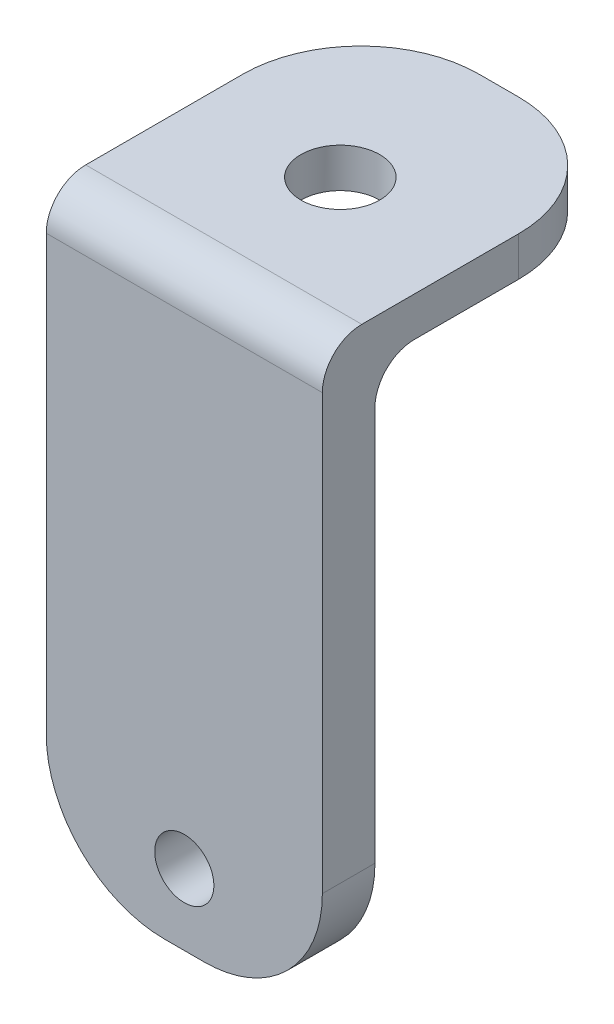
ISO-10303-21;
HEADER;
FILE_DESCRIPTION(('STEP AP214'),'2;1');
FILE_NAME('part.step','',(''),(''),'','','');
FILE_SCHEMA(('AUTOMOTIVE_DESIGN { 1 0 10303 214 1 1 1 1 }'));
ENDSEC;
DATA;
#1=APPLICATION_CONTEXT('core data for automotive mechanical design processes');
#2=APPLICATION_PROTOCOL_DEFINITION('international standard','automotive_design',2000,#1);
#3=PRODUCT_CONTEXT('',#1,'mechanical');
#4=PRODUCT('Part','Part','',(#3));
#5=PRODUCT_RELATED_PRODUCT_CATEGORY('part','',(#4));
#6=PRODUCT_DEFINITION_FORMATION('','',#4);
#7=PRODUCT_DEFINITION_CONTEXT('part definition',#1,'design');
#8=PRODUCT_DEFINITION('design','',#6,#7);
#9=PRODUCT_DEFINITION_SHAPE('','',#8);
#10=(LENGTH_UNIT() NAMED_UNIT(*) SI_UNIT(.MILLI.,.METRE.));
#11=(NAMED_UNIT(*) PLANE_ANGLE_UNIT() SI_UNIT($,.RADIAN.));
#12=(NAMED_UNIT(*) SI_UNIT($,.STERADIAN.) SOLID_ANGLE_UNIT());
#13=UNCERTAINTY_MEASURE_WITH_UNIT(LENGTH_MEASURE(1.E-05),#10,'distance_accuracy_value','');
#14=(GEOMETRIC_REPRESENTATION_CONTEXT(3) GLOBAL_UNCERTAINTY_ASSIGNED_CONTEXT((#13)) GLOBAL_UNIT_ASSIGNED_CONTEXT((#10,
#11,#12)) REPRESENTATION_CONTEXT('',''));
#15=CARTESIAN_POINT('',(0.,0.,0.));
#16=DIRECTION('',(0.,0.,1.));
#17=DIRECTION('',(1.,0.,0.));
#18=AXIS2_PLACEMENT_3D('',#15,#16,#17);
#19=CARTESIAN_POINT('',(-35.,210.217693310135,42.0569210181725));
#20=DIRECTION('',(0.,1.,0.));
#21=DIRECTION('',(0.,0.,1.));
#22=AXIS2_PLACEMENT_3D('',#19,#20,#21);
#23=PLANE('',#22);
#24=CARTESIAN_POINT('',(0.,210.217693310135,2.5));
#25=DIRECTION('',(0.,1.,0.));
#26=DIRECTION('',(0.,0.,1.));
#27=AXIS2_PLACEMENT_3D('',#24,#25,#26);
#28=CIRCLE('',#27,10.);
#29=CARTESIAN_POINT('',(0.,210.217693310135,12.5));
#30=VERTEX_POINT('',#29);
#31=EDGE_CURVE('E169',#30,#30,#28,.T.);
#32=ORIENTED_EDGE('',*,*,#31,.F.);
#33=EDGE_LOOP('',(#32));
#34=FACE_BOUND('',#33,.T.);
#35=DIRECTION('',(0.,0.,1.));
#36=VECTOR('',#35,1.);
#37=CARTESIAN_POINT('',(-35.,210.217693310135,42.0569210181725));
#38=LINE('',#37,#36);
#39=CARTESIAN_POINT('',(-35.,210.217693310135,-7.73203002231183));
#40=VERTEX_POINT('',#39);
#41=CARTESIAN_POINT('',(-35.,210.217693310135,32.0569210181725));
#42=VERTEX_POINT('',#41);
#43=EDGE_CURVE('E158',#40,#42,#38,.T.);
#44=ORIENTED_EDGE('',*,*,#43,.T.);
#45=DIRECTION('',(1.,0.,0.));
#46=VECTOR('',#45,1.);
#47=CARTESIAN_POINT('',(-35.,210.217693310135,32.0569210181725));
#48=LINE('',#47,#46);
#49=CARTESIAN_POINT('',(35.,210.217693310135,32.0569210181725));
#50=VERTEX_POINT('',#49);
#51=EDGE_CURVE('E200',#42,#50,#48,.T.);
#52=ORIENTED_EDGE('',*,*,#51,.T.);
#53=DIRECTION('',(0.,0.,1.));
#54=VECTOR('',#53,1.);
#55=CARTESIAN_POINT('',(35.,210.217693310135,42.0569210181725));
#56=LINE('',#55,#54);
#57=CARTESIAN_POINT('',(35.,210.217693310135,-7.73203002231183));
#58=VERTEX_POINT('',#57);
#59=EDGE_CURVE('E224',#58,#50,#56,.T.);
#60=ORIENTED_EDGE('',*,*,#59,.F.);
#61=CARTESIAN_POINT('',(4.99999999999998,210.217693310135,-7.73203002231183));
#62=DIRECTION('',(0.,1.,0.));
#63=DIRECTION('',(0.,0.,1.));
#64=AXIS2_PLACEMENT_3D('',#61,#62,#63);
#65=CIRCLE('',#64,30.);
#66=CARTESIAN_POINT('',(4.99999999999998,210.217693310135,-37.7320300223118));
#67=VERTEX_POINT('',#66);
#68=EDGE_CURVE('E140',#58,#67,#65,.T.);
#69=ORIENTED_EDGE('',*,*,#68,.T.);
#70=DIRECTION('',(1.,0.,0.));
#71=VECTOR('',#70,1.);
#72=CARTESIAN_POINT('',(-35.,210.217693310135,-37.7320300223118));
#73=LINE('',#72,#71);
#74=CARTESIAN_POINT('',(-5.,210.217693310135,-37.7320300223118));
#75=VERTEX_POINT('',#74);
#76=EDGE_CURVE('E146',#75,#67,#73,.T.);
#77=ORIENTED_EDGE('',*,*,#76,.F.);
#78=CARTESIAN_POINT('',(-5.,210.217693310135,-7.73203002231183));
#79=DIRECTION('',(0.,1.,0.));
#80=DIRECTION('',(0.,0.,1.));
#81=AXIS2_PLACEMENT_3D('',#78,#79,#80);
#82=CIRCLE('',#81,30.);
#83=EDGE_CURVE('E128',#75,#40,#82,.T.);
#84=ORIENTED_EDGE('',*,*,#83,.T.);
#85=EDGE_LOOP('',(#44,#52,#60,#69,#77,#84));
#86=FACE_BOUND('',#85,.T.);
#87=ADVANCED_FACE('F39',(#34,#86),#23,.T.);
#88=CARTESIAN_POINT('',(-35.,210.217693310135,-37.7320300223118));
#89=DIRECTION('',(0.,0.,-1.));
#90=DIRECTION('',(0.,1.,0.));
#91=AXIS2_PLACEMENT_3D('',#88,#89,#90);
#92=PLANE('',#91);
#93=DIRECTION('',(1.,0.,0.));
#94=VECTOR('',#93,1.);
#95=CARTESIAN_POINT('',(-35.,200.217693310135,-37.7320300223118));
#96=LINE('',#95,#94);
#97=CARTESIAN_POINT('',(-5.,200.217693310135,-37.7320300223118));
#98=VERTEX_POINT('',#97);
#99=CARTESIAN_POINT('',(4.99999999999998,200.217693310135,-37.7320300223118));
#100=VERTEX_POINT('',#99);
#101=EDGE_CURVE('E149',#98,#100,#96,.T.);
#102=ORIENTED_EDGE('',*,*,#101,.F.);
#103=DIRECTION('',(0.,1.,0.));
#104=VECTOR('',#103,1.);
#105=CARTESIAN_POINT('',(-5.,210.217693310135,-37.7320300223118));
#106=LINE('',#105,#104);
#107=EDGE_CURVE('E132',#98,#75,#106,.T.);
#108=ORIENTED_EDGE('',*,*,#107,.T.);
#109=ORIENTED_EDGE('',*,*,#76,.T.);
#110=DIRECTION('',(0.,1.,0.));
#111=VECTOR('',#110,1.);
#112=CARTESIAN_POINT('',(4.99999999999998,210.217693310135,-37.7320300223118));
#113=LINE('',#112,#111);
#114=EDGE_CURVE('E150',#67,#100,#113,.F.);
#115=ORIENTED_EDGE('',*,*,#114,.T.);
#116=EDGE_LOOP('',(#102,#108,#109,#115));
#117=FACE_BOUND('',#116,.T.);
#118=ADVANCED_FACE('F145',(#117),#92,.T.);
#119=CARTESIAN_POINT('',(-35.,200.217693310135,28.7170376465665));
#120=DIRECTION('',(0.,-1.,0.));
#121=DIRECTION('',(0.,0.,-1.));
#122=AXIS2_PLACEMENT_3D('',#119,#120,#121);
#123=PLANE('',#122);
#124=CARTESIAN_POINT('',(0.,200.217693310135,2.5));
#125=DIRECTION('',(0.,-1.,0.));
#126=DIRECTION('',(0.,0.,-1.));
#127=AXIS2_PLACEMENT_3D('',#124,#125,#126);
#128=CIRCLE('',#127,10.);
#129=CARTESIAN_POINT('',(0.,200.217693310135,-7.5));
#130=VERTEX_POINT('',#129);
#131=EDGE_CURVE('E166',#130,#130,#128,.T.);
#132=ORIENTED_EDGE('',*,*,#131,.F.);
#133=EDGE_LOOP('',(#132));
#134=FACE_BOUND('',#133,.T.);
#135=DIRECTION('',(0.,0.,-1.));
#136=VECTOR('',#135,1.);
#137=CARTESIAN_POINT('',(35.,200.217693310135,28.7170376465665));
#138=LINE('',#137,#136);
#139=CARTESIAN_POINT('',(35.,200.217693310135,18.7170376465665));
#140=VERTEX_POINT('',#139);
#141=CARTESIAN_POINT('',(35.,200.217693310135,-7.73203002231183));
#142=VERTEX_POINT('',#141);
#143=EDGE_CURVE('E216',#140,#142,#138,.T.);
#144=ORIENTED_EDGE('',*,*,#143,.F.);
#145=DIRECTION('',(1.,0.,0.));
#146=VECTOR('',#145,1.);
#147=CARTESIAN_POINT('',(-35.,200.217693310135,18.7170376465665));
#148=LINE('',#147,#146);
#149=CARTESIAN_POINT('',(-35.,200.217693310135,18.7170376465665));
#150=VERTEX_POINT('',#149);
#151=EDGE_CURVE('E60',#140,#150,#148,.F.);
#152=ORIENTED_EDGE('',*,*,#151,.T.);
#153=DIRECTION('',(0.,0.,-1.));
#154=VECTOR('',#153,1.);
#155=CARTESIAN_POINT('',(-35.,200.217693310135,28.7170376465665));
#156=LINE('',#155,#154);
#157=CARTESIAN_POINT('',(-35.,200.217693310135,-7.73203002231183));
#158=VERTEX_POINT('',#157);
#159=EDGE_CURVE('E231',#150,#158,#156,.T.);
#160=ORIENTED_EDGE('',*,*,#159,.T.);
#161=CARTESIAN_POINT('',(-5.,200.217693310135,-7.73203002231183));
#162=DIRECTION('',(0.,-1.,0.));
#163=DIRECTION('',(0.,0.,-1.));
#164=AXIS2_PLACEMENT_3D('',#161,#162,#163);
#165=CIRCLE('',#164,30.);
#166=EDGE_CURVE('E178',#158,#98,#165,.T.);
#167=ORIENTED_EDGE('',*,*,#166,.T.);
#168=ORIENTED_EDGE('',*,*,#101,.T.);
#169=CARTESIAN_POINT('',(4.99999999999998,200.217693310135,-7.73203002231183));
#170=DIRECTION('',(0.,-1.,0.));
#171=DIRECTION('',(0.,0.,-1.));
#172=AXIS2_PLACEMENT_3D('',#169,#170,#171);
#173=CIRCLE('',#172,30.);
#174=EDGE_CURVE('E175',#100,#142,#173,.T.);
#175=ORIENTED_EDGE('',*,*,#174,.T.);
#176=EDGE_LOOP('',(#144,#152,#160,#167,#168,#175));
#177=FACE_BOUND('',#176,.T.);
#178=ADVANCED_FACE('F221',(#134,#177),#123,.T.);
#179=CARTESIAN_POINT('',(-35.,60.2176933101346,28.7170376465665));
#180=DIRECTION('',(0.,0.,-1.));
#181=DIRECTION('',(-1.,0.,0.));
#182=AXIS2_PLACEMENT_3D('',#179,#180,#181);
#183=PLANE('',#182);
#184=CARTESIAN_POINT('',(0.,78.2176933101346,28.7170376465665));
#185=DIRECTION('',(0.,0.,-1.));
#186=DIRECTION('',(-1.,0.,0.));
#187=AXIS2_PLACEMENT_3D('',#184,#185,#186);
#188=CIRCLE('',#187,7.50000000000001);
#189=CARTESIAN_POINT('',(-7.5,78.2176933101346,28.7170376465665));
#190=VERTEX_POINT('',#189);
#191=EDGE_CURVE('E241',#190,#190,#188,.T.);
#192=ORIENTED_EDGE('',*,*,#191,.F.);
#193=EDGE_LOOP('',(#192));
#194=FACE_BOUND('',#193,.T.);
#195=DIRECTION('',(0.,1.,0.));
#196=VECTOR('',#195,1.);
#197=CARTESIAN_POINT('',(-35.,60.2176933101346,28.7170376465665));
#198=LINE('',#197,#196);
#199=CARTESIAN_POINT('',(-35.,90.2176933101346,28.7170376465665));
#200=VERTEX_POINT('',#199);
#201=CARTESIAN_POINT('',(-35.,190.217693310135,28.7170376465665));
#202=VERTEX_POINT('',#201);
#203=EDGE_CURVE('E228',#200,#202,#198,.T.);
#204=ORIENTED_EDGE('',*,*,#203,.T.);
#205=DIRECTION('',(1.,0.,0.));
#206=VECTOR('',#205,1.);
#207=CARTESIAN_POINT('',(35.,190.217693310135,28.7170376465665));
#208=LINE('',#207,#206);
#209=CARTESIAN_POINT('',(35.,190.217693310135,28.7170376465665));
#210=VERTEX_POINT('',#209);
#211=EDGE_CURVE('E209',#202,#210,#208,.T.);
#212=ORIENTED_EDGE('',*,*,#211,.T.);
#213=DIRECTION('',(0.,1.,0.));
#214=VECTOR('',#213,1.);
#215=CARTESIAN_POINT('',(35.,60.2176933101346,28.7170376465665));
#216=LINE('',#215,#214);
#217=CARTESIAN_POINT('',(35.,90.2176933101346,28.7170376465665));
#218=VERTEX_POINT('',#217);
#219=EDGE_CURVE('E218',#218,#210,#216,.T.);
#220=ORIENTED_EDGE('',*,*,#219,.F.);
#221=CARTESIAN_POINT('',(4.99999999999998,90.2176933101346,28.7170376465665));
#222=DIRECTION('',(0.,0.,-1.));
#223=DIRECTION('',(-1.,0.,0.));
#224=AXIS2_PLACEMENT_3D('',#221,#222,#223);
#225=CIRCLE('',#224,30.);
#226=CARTESIAN_POINT('',(4.99999999999998,60.2176933101346,28.7170376465665));
#227=VERTEX_POINT('',#226);
#228=EDGE_CURVE('E191',#218,#227,#225,.T.);
#229=ORIENTED_EDGE('',*,*,#228,.T.);
#230=DIRECTION('',(1.,0.,0.));
#231=VECTOR('',#230,1.);
#232=CARTESIAN_POINT('',(-35.,60.2176933101346,28.7170376465665));
#233=LINE('',#232,#231);
#234=CARTESIAN_POINT('',(-5.,60.2176933101346,28.7170376465665));
#235=VERTEX_POINT('',#234);
#236=EDGE_CURVE('E155',#235,#227,#233,.T.);
#237=ORIENTED_EDGE('',*,*,#236,.F.);
#238=CARTESIAN_POINT('',(-5.,90.2176933101346,28.7170376465665));
#239=DIRECTION('',(0.,0.,-1.));
#240=DIRECTION('',(-1.,0.,0.));
#241=AXIS2_PLACEMENT_3D('',#238,#239,#240);
#242=CIRCLE('',#241,30.);
#243=EDGE_CURVE('E193',#235,#200,#242,.T.);
#244=ORIENTED_EDGE('',*,*,#243,.T.);
#245=EDGE_LOOP('',(#204,#212,#220,#229,#237,#244));
#246=FACE_BOUND('',#245,.T.);
#247=ADVANCED_FACE('F227',(#194,#246),#183,.T.);
#248=CARTESIAN_POINT('',(-35.,60.2176933101346,42.0569210181725));
#249=DIRECTION('',(0.,-1.,0.));
#250=DIRECTION('',(0.,0.,-1.));
#251=AXIS2_PLACEMENT_3D('',#248,#249,#250);
#252=PLANE('',#251);
#253=DIRECTION('',(1.,0.,0.));
#254=VECTOR('',#253,1.);
#255=CARTESIAN_POINT('',(-35.,60.2176933101346,42.0569210181725));
#256=LINE('',#255,#254);
#257=CARTESIAN_POINT('',(-5.,60.2176933101346,42.0569210181725));
#258=VERTEX_POINT('',#257);
#259=CARTESIAN_POINT('',(4.99999999999998,60.2176933101346,42.0569210181725));
#260=VERTEX_POINT('',#259);
#261=EDGE_CURVE('E163',#258,#260,#256,.T.);
#262=ORIENTED_EDGE('',*,*,#261,.F.);
#263=DIRECTION('',(0.,0.,-1.));
#264=VECTOR('',#263,1.);
#265=CARTESIAN_POINT('',(-5.,60.2176933101346,28.7170376465665));
#266=LINE('',#265,#264);
#267=EDGE_CURVE('E188',#258,#235,#266,.T.);
#268=ORIENTED_EDGE('',*,*,#267,.T.);
#269=ORIENTED_EDGE('',*,*,#236,.T.);
#270=DIRECTION('',(0.,0.,-1.));
#271=VECTOR('',#270,1.);
#272=CARTESIAN_POINT('',(4.99999999999998,60.2176933101346,42.0569210181725));
#273=LINE('',#272,#271);
#274=EDGE_CURVE('E186',#227,#260,#273,.F.);
#275=ORIENTED_EDGE('',*,*,#274,.T.);
#276=EDGE_LOOP('',(#262,#268,#269,#275));
#277=FACE_BOUND('',#276,.T.);
#278=ADVANCED_FACE('F254',(#277),#252,.T.);
#279=CARTESIAN_POINT('',(-35.,166.399972685061,42.0569210181725));
#280=DIRECTION('',(0.,0.,1.));
#281=DIRECTION('',(1.,0.,0.));
#282=AXIS2_PLACEMENT_3D('',#279,#280,#281);
#283=PLANE('',#282);
#284=CARTESIAN_POINT('',(0.,78.2176933101346,42.0569210181725));
#285=DIRECTION('',(0.,0.,1.));
#286=DIRECTION('',(1.,0.,0.));
#287=AXIS2_PLACEMENT_3D('',#284,#285,#286);
#288=CIRCLE('',#287,7.50000000000001);
#289=CARTESIAN_POINT('',(7.50000000000001,78.2176933101346,42.0569210181725));
#290=VERTEX_POINT('',#289);
#291=EDGE_CURVE('E244',#290,#290,#288,.T.);
#292=ORIENTED_EDGE('',*,*,#291,.F.);
#293=EDGE_LOOP('',(#292));
#294=FACE_BOUND('',#293,.T.);
#295=DIRECTION('',(0.,-1.,0.));
#296=VECTOR('',#295,1.);
#297=CARTESIAN_POINT('',(35.,210.217693310135,42.0569210181725));
#298=LINE('',#297,#296);
#299=CARTESIAN_POINT('',(35.,200.217693310135,42.0569210181725));
#300=VERTEX_POINT('',#299);
#301=CARTESIAN_POINT('',(35.,90.2176933101346,42.0569210181725));
#302=VERTEX_POINT('',#301);
#303=EDGE_CURVE('E168',#300,#302,#298,.T.);
#304=ORIENTED_EDGE('',*,*,#303,.F.);
#305=DIRECTION('',(1.,0.,0.));
#306=VECTOR('',#305,1.);
#307=CARTESIAN_POINT('',(-35.,200.217693310135,42.0569210181725));
#308=LINE('',#307,#306);
#309=CARTESIAN_POINT('',(-35.,200.217693310135,42.0569210181725));
#310=VERTEX_POINT('',#309);
#311=EDGE_CURVE('E205',#300,#310,#308,.F.);
#312=ORIENTED_EDGE('',*,*,#311,.T.);
#313=DIRECTION('',(0.,-1.,0.));
#314=VECTOR('',#313,1.);
#315=CARTESIAN_POINT('',(-35.,210.217693310135,42.0569210181725));
#316=LINE('',#315,#314);
#317=CARTESIAN_POINT('',(-35.,90.2176933101346,42.0569210181725));
#318=VERTEX_POINT('',#317);
#319=EDGE_CURVE('E232',#310,#318,#316,.T.);
#320=ORIENTED_EDGE('',*,*,#319,.T.);
#321=CARTESIAN_POINT('',(-5.,90.2176933101346,42.0569210181725));
#322=DIRECTION('',(0.,0.,1.));
#323=DIRECTION('',(1.,0.,0.));
#324=AXIS2_PLACEMENT_3D('',#321,#322,#323);
#325=CIRCLE('',#324,30.);
#326=EDGE_CURVE('E198',#318,#258,#325,.T.);
#327=ORIENTED_EDGE('',*,*,#326,.T.);
#328=ORIENTED_EDGE('',*,*,#261,.T.);
#329=CARTESIAN_POINT('',(4.99999999999998,90.2176933101346,42.0569210181725));
#330=DIRECTION('',(0.,0.,1.));
#331=DIRECTION('',(1.,0.,0.));
#332=AXIS2_PLACEMENT_3D('',#329,#330,#331);
#333=CIRCLE('',#332,30.);
#334=EDGE_CURVE('E195',#260,#302,#333,.T.);
#335=ORIENTED_EDGE('',*,*,#334,.T.);
#336=EDGE_LOOP('',(#304,#312,#320,#327,#328,#335));
#337=FACE_BOUND('',#336,.T.);
#338=ADVANCED_FACE('F250',(#294,#337),#283,.T.);
#339=CARTESIAN_POINT('',(-35.,0.,0.));
#340=DIRECTION('',(1.,0.,0.));
#341=DIRECTION('',(0.,0.,-1.));
#342=AXIS2_PLACEMENT_3D('',#339,#340,#341);
#343=PLANE('',#342);
#344=ORIENTED_EDGE('',*,*,#319,.F.);
#345=CARTESIAN_POINT('',(-35.,200.217693310135,32.0569210181725));
#346=DIRECTION('',(1.,0.,0.));
#347=DIRECTION('',(0.,0.,-1.));
#348=AXIS2_PLACEMENT_3D('',#345,#346,#347);
#349=CIRCLE('',#348,10.);
#350=EDGE_CURVE('E207',#310,#42,#349,.F.);
#351=ORIENTED_EDGE('',*,*,#350,.T.);
#352=ORIENTED_EDGE('',*,*,#43,.F.);
#353=DIRECTION('',(0.,1.,0.));
#354=VECTOR('',#353,1.);
#355=CARTESIAN_POINT('',(-35.,200.217693310135,-7.73203002231183));
#356=LINE('',#355,#354);
#357=EDGE_CURVE('E134',#40,#158,#356,.F.);
#358=ORIENTED_EDGE('',*,*,#357,.T.);
#359=ORIENTED_EDGE('',*,*,#159,.F.);
#360=CARTESIAN_POINT('',(-35.,190.217693310135,18.7170376465665));
#361=DIRECTION('',(1.,0.,0.));
#362=DIRECTION('',(0.,0.,-1.));
#363=AXIS2_PLACEMENT_3D('',#360,#361,#362);
#364=CIRCLE('',#363,10.);
#365=EDGE_CURVE('E11',#150,#202,#364,.T.);
#366=ORIENTED_EDGE('',*,*,#365,.T.);
#367=ORIENTED_EDGE('',*,*,#203,.F.);
#368=DIRECTION('',(0.,0.,-1.));
#369=VECTOR('',#368,1.);
#370=CARTESIAN_POINT('',(-35.,90.2176933101346,42.0569210181725));
#371=LINE('',#370,#369);
#372=EDGE_CURVE('E139',#200,#318,#371,.F.);
#373=ORIENTED_EDGE('',*,*,#372,.T.);
#374=EDGE_LOOP('',(#344,#351,#352,#358,#359,#366,#367,#373));
#375=FACE_BOUND('',#374,.T.);
#376=ADVANCED_FACE('F253',(#375),#343,.F.);
#377=CARTESIAN_POINT('',(35.,0.,0.));
#378=DIRECTION('',(1.,0.,0.));
#379=DIRECTION('',(0.,0.,-1.));
#380=AXIS2_PLACEMENT_3D('',#377,#378,#379);
#381=PLANE('',#380);
#382=ORIENTED_EDGE('',*,*,#59,.T.);
#383=CARTESIAN_POINT('',(35.,200.217693310135,32.0569210181725));
#384=DIRECTION('',(1.,0.,0.));
#385=DIRECTION('',(0.,0.,-1.));
#386=AXIS2_PLACEMENT_3D('',#383,#384,#385);
#387=CIRCLE('',#386,10.);
#388=EDGE_CURVE('E203',#50,#300,#387,.T.);
#389=ORIENTED_EDGE('',*,*,#388,.T.);
#390=ORIENTED_EDGE('',*,*,#303,.T.);
#391=DIRECTION('',(0.,0.,-1.));
#392=VECTOR('',#391,1.);
#393=CARTESIAN_POINT('',(35.,90.2176933101346,0.));
#394=LINE('',#393,#392);
#395=EDGE_CURVE('E180',#302,#218,#394,.T.);
#396=ORIENTED_EDGE('',*,*,#395,.T.);
#397=ORIENTED_EDGE('',*,*,#219,.T.);
#398=CARTESIAN_POINT('',(35.,190.217693310135,18.7170376465665));
#399=DIRECTION('',(1.,0.,0.));
#400=DIRECTION('',(0.,0.,-1.));
#401=AXIS2_PLACEMENT_3D('',#398,#399,#400);
#402=CIRCLE('',#401,10.);
#403=EDGE_CURVE('E47',#210,#140,#402,.F.);
#404=ORIENTED_EDGE('',*,*,#403,.T.);
#405=ORIENTED_EDGE('',*,*,#143,.T.);
#406=DIRECTION('',(0.,1.,0.));
#407=VECTOR('',#406,1.);
#408=CARTESIAN_POINT('',(35.,0.,-7.73203002231169));
#409=LINE('',#408,#407);
#410=EDGE_CURVE('E183',#142,#58,#409,.T.);
#411=ORIENTED_EDGE('',*,*,#410,.T.);
#412=EDGE_LOOP('',(#382,#389,#390,#396,#397,#404,#405,#411));
#413=FACE_BOUND('',#412,.T.);
#414=ADVANCED_FACE('F215',(#413),#381,.T.);
#415=CARTESIAN_POINT('',(0.,175.217693310135,2.5));
#416=DIRECTION('',(0.,1.,0.));
#417=DIRECTION('',(0.,0.,1.));
#418=AXIS2_PLACEMENT_3D('',#415,#416,#417);
#419=CYLINDRICAL_SURFACE('',#418,10.);
#420=ORIENTED_EDGE('',*,*,#131,.T.);
#421=EDGE_LOOP('',(#420));
#422=FACE_BOUND('',#421,.T.);
#423=ORIENTED_EDGE('',*,*,#31,.T.);
#424=EDGE_LOOP('',(#423));
#425=FACE_BOUND('',#424,.T.);
#426=ADVANCED_FACE('F336',(#422,#425),#419,.F.);
#427=CARTESIAN_POINT('',(0.,78.2176933101346,-37.7320300223118));
#428=DIRECTION('',(0.,0.,1.));
#429=DIRECTION('',(1.,0.,0.));
#430=AXIS2_PLACEMENT_3D('',#427,#428,#429);
#431=CYLINDRICAL_SURFACE('',#430,7.50000000000001);
#432=ORIENTED_EDGE('',*,*,#191,.T.);
#433=EDGE_LOOP('',(#432));
#434=FACE_BOUND('',#433,.T.);
#435=ORIENTED_EDGE('',*,*,#291,.T.);
#436=EDGE_LOOP('',(#435));
#437=FACE_BOUND('',#436,.T.);
#438=ADVANCED_FACE('F248',(#434,#437),#431,.F.);
#439=CARTESIAN_POINT('',(-5.,210.217693310135,-7.73203002231183));
#440=DIRECTION('',(0.,-1.,0.));
#441=DIRECTION('',(0.,0.,-1.));
#442=AXIS2_PLACEMENT_3D('',#439,#440,#441);
#443=CYLINDRICAL_SURFACE('',#442,30.);
#444=ORIENTED_EDGE('',*,*,#166,.F.);
#445=ORIENTED_EDGE('',*,*,#357,.F.);
#446=ORIENTED_EDGE('',*,*,#83,.F.);
#447=ORIENTED_EDGE('',*,*,#107,.F.);
#448=EDGE_LOOP('',(#444,#445,#446,#447));
#449=FACE_BOUND('',#448,.T.);
#450=ADVANCED_FACE('F131',(#449),#443,.T.);
#451=CARTESIAN_POINT('',(4.99999999999998,0.,-7.73203002231169));
#452=DIRECTION('',(0.,1.,0.));
#453=DIRECTION('',(0.,0.,1.));
#454=AXIS2_PLACEMENT_3D('',#451,#452,#453);
#455=CYLINDRICAL_SURFACE('',#454,30.);
#456=ORIENTED_EDGE('',*,*,#174,.F.);
#457=ORIENTED_EDGE('',*,*,#114,.F.);
#458=ORIENTED_EDGE('',*,*,#68,.F.);
#459=ORIENTED_EDGE('',*,*,#410,.F.);
#460=EDGE_LOOP('',(#456,#457,#458,#459));
#461=FACE_BOUND('',#460,.T.);
#462=ADVANCED_FACE('F266',(#461),#455,.T.);
#463=CARTESIAN_POINT('',(-5.,90.2176933101346,42.0569210181725));
#464=DIRECTION('',(0.,0.,1.));
#465=DIRECTION('',(1.,0.,0.));
#466=AXIS2_PLACEMENT_3D('',#463,#464,#465);
#467=CYLINDRICAL_SURFACE('',#466,30.);
#468=ORIENTED_EDGE('',*,*,#326,.F.);
#469=ORIENTED_EDGE('',*,*,#372,.F.);
#470=ORIENTED_EDGE('',*,*,#243,.F.);
#471=ORIENTED_EDGE('',*,*,#267,.F.);
#472=EDGE_LOOP('',(#468,#469,#470,#471));
#473=FACE_BOUND('',#472,.T.);
#474=ADVANCED_FACE('F268',(#473),#467,.T.);
#475=CARTESIAN_POINT('',(4.99999999999998,90.2176933101346,0.));
#476=DIRECTION('',(0.,0.,-1.));
#477=DIRECTION('',(-1.,0.,0.));
#478=AXIS2_PLACEMENT_3D('',#475,#476,#477);
#479=CYLINDRICAL_SURFACE('',#478,30.);
#480=ORIENTED_EDGE('',*,*,#334,.F.);
#481=ORIENTED_EDGE('',*,*,#274,.F.);
#482=ORIENTED_EDGE('',*,*,#228,.F.);
#483=ORIENTED_EDGE('',*,*,#395,.F.);
#484=EDGE_LOOP('',(#480,#481,#482,#483));
#485=FACE_BOUND('',#484,.T.);
#486=ADVANCED_FACE('F274',(#485),#479,.T.);
#487=CARTESIAN_POINT('',(-35.,200.217693310135,32.0569210181725));
#488=DIRECTION('',(1.,0.,0.));
#489=DIRECTION('',(0.,0.,-1.));
#490=AXIS2_PLACEMENT_3D('',#487,#488,#489);
#491=CYLINDRICAL_SURFACE('',#490,10.);
#492=ORIENTED_EDGE('',*,*,#350,.F.);
#493=ORIENTED_EDGE('',*,*,#311,.F.);
#494=ORIENTED_EDGE('',*,*,#388,.F.);
#495=ORIENTED_EDGE('',*,*,#51,.F.);
#496=EDGE_LOOP('',(#492,#493,#494,#495));
#497=FACE_BOUND('',#496,.T.);
#498=ADVANCED_FACE('F263',(#497),#491,.T.);
#499=CARTESIAN_POINT('',(-35.,190.217693310135,18.7170376465665));
#500=DIRECTION('',(-1.,0.,0.));
#501=DIRECTION('',(0.,0.,1.));
#502=AXIS2_PLACEMENT_3D('',#499,#500,#501);
#503=CYLINDRICAL_SURFACE('',#502,10.);
#504=ORIENTED_EDGE('',*,*,#365,.F.);
#505=ORIENTED_EDGE('',*,*,#151,.F.);
#506=ORIENTED_EDGE('',*,*,#403,.F.);
#507=ORIENTED_EDGE('',*,*,#211,.F.);
#508=EDGE_LOOP('',(#504,#505,#506,#507));
#509=FACE_BOUND('',#508,.T.);
#510=ADVANCED_FACE('F41',(#509),#503,.F.);
#511=CLOSED_SHELL('',(#87,#118,#178,#247,#278,#338,#376,#414,#426,#438,#450,#462,#474,#486,#498,#510));
#512=MANIFOLD_SOLID_BREP('B2',#511);
#513=ADVANCED_BREP_SHAPE_REPRESENTATION('',(#18,#512),#14);
#514=SHAPE_DEFINITION_REPRESENTATION(#9,#513);
ENDSEC;
END-ISO-10303-21;
